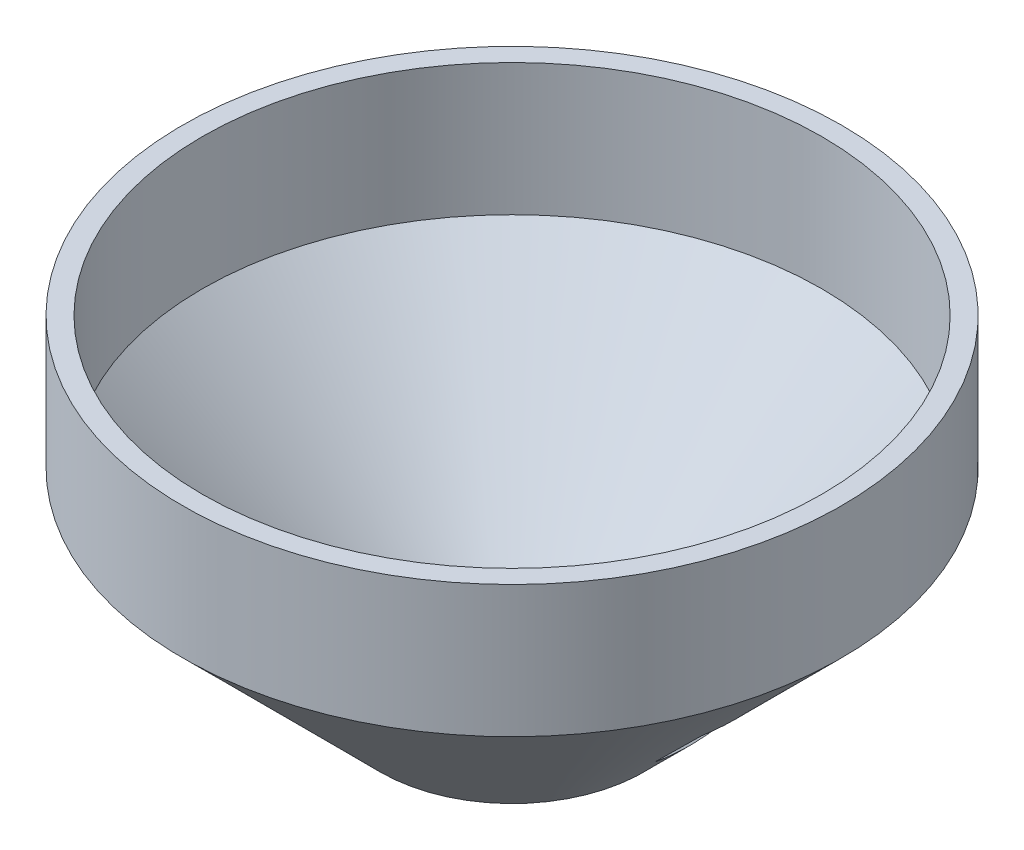
ISO-10303-21;
HEADER;
FILE_DESCRIPTION(('STEP AP214'),'2;1');
FILE_NAME('part.step','',(''),(''),'','','');
FILE_SCHEMA(('AUTOMOTIVE_DESIGN { 1 0 10303 214 1 1 1 1 }'));
ENDSEC;
DATA;
#1=APPLICATION_CONTEXT('core data for automotive mechanical design processes');
#2=APPLICATION_PROTOCOL_DEFINITION('international standard','automotive_design',2000,#1);
#3=PRODUCT_CONTEXT('',#1,'mechanical');
#4=PRODUCT('Part','Part','',(#3));
#5=PRODUCT_RELATED_PRODUCT_CATEGORY('part','',(#4));
#6=PRODUCT_DEFINITION_FORMATION('','',#4);
#7=PRODUCT_DEFINITION_CONTEXT('part definition',#1,'design');
#8=PRODUCT_DEFINITION('design','',#6,#7);
#9=PRODUCT_DEFINITION_SHAPE('','',#8);
#10=(LENGTH_UNIT() NAMED_UNIT(*) SI_UNIT(.MILLI.,.METRE.));
#11=(NAMED_UNIT(*) PLANE_ANGLE_UNIT() SI_UNIT($,.RADIAN.));
#12=(NAMED_UNIT(*) SI_UNIT($,.STERADIAN.) SOLID_ANGLE_UNIT());
#13=UNCERTAINTY_MEASURE_WITH_UNIT(LENGTH_MEASURE(1.E-05),#10,'distance_accuracy_value','');
#14=(GEOMETRIC_REPRESENTATION_CONTEXT(3) GLOBAL_UNCERTAINTY_ASSIGNED_CONTEXT((#13)) GLOBAL_UNIT_ASSIGNED_CONTEXT((#10,
#11,#12)) REPRESENTATION_CONTEXT('',''));
#15=CARTESIAN_POINT('',(0.,0.,0.));
#16=DIRECTION('',(0.,0.,1.));
#17=DIRECTION('',(1.,0.,0.));
#18=AXIS2_PLACEMENT_3D('',#15,#16,#17);
#19=CARTESIAN_POINT('',(0.,30.,0.));
#20=DIRECTION('',(0.,1.,0.));
#21=DIRECTION('',(0.,0.,1.));
#22=AXIS2_PLACEMENT_3D('',#19,#20,#21);
#23=CONICAL_SURFACE('',#22,47.,0.78539816339745);
#24=CARTESIAN_POINT('',(0.,0.,0.));
#25=DIRECTION('',(0.,-1.,0.));
#26=DIRECTION('',(0.,0.,-1.));
#27=AXIS2_PLACEMENT_3D('',#24,#25,#26);
#28=CIRCLE('',#27,16.9999999999999);
#29=CARTESIAN_POINT('',(0.,0.,-16.9999999999999));
#30=VERTEX_POINT('',#29);
#31=EDGE_CURVE('E249',#30,#30,#28,.T.);
#32=ORIENTED_EDGE('',*,*,#31,.T.);
#33=EDGE_LOOP('',(#32));
#34=FACE_BOUND('',#33,.T.);
#35=CARTESIAN_POINT('',(0.,30.,0.));
#36=DIRECTION('',(0.,-1.,0.));
#37=DIRECTION('',(0.,0.,-1.));
#38=AXIS2_PLACEMENT_3D('',#35,#36,#37);
#39=CIRCLE('',#38,47.);
#40=CARTESIAN_POINT('',(0.,30.,-47.));
#41=VERTEX_POINT('',#40);
#42=EDGE_CURVE('E252',#41,#41,#39,.T.);
#43=ORIENTED_EDGE('',*,*,#42,.F.);
#44=EDGE_LOOP('',(#43));
#45=FACE_BOUND('',#44,.T.);
#46=CARTESIAN_POINT('',(32.4365220756595,15.8481259873356,5.18376470483706));
#47=CARTESIAN_POINT('',(32.4694450800554,15.8150731722791,4.76835895172613));
#48=CARTESIAN_POINT('',(32.498458012653,15.7859560803706,4.35232807358459));
#49=CARTESIAN_POINT('',(32.5485988600801,15.7356632888784,3.51932975536683));
#50=CARTESIAN_POINT('',(32.5697270985214,15.7144872633688,3.10236235443518));
#51=CARTESIAN_POINT('',(32.6040365546045,15.6801436679165,2.26776668741939));
#52=CARTESIAN_POINT('',(32.617217699118,15.6669761716673,1.85013841528943));
#53=CARTESIAN_POINT('',(32.6355739481844,15.6486654615326,1.01451238189933));
#54=CARTESIAN_POINT('',(32.6407487170047,15.6435225841446,0.596514605880074));
#55=CARTESIAN_POINT('',(32.6430272524225,15.641243931721,-0.236874199899568));
#56=CARTESIAN_POINT('',(32.6401819845196,15.6440575950556,-0.652264953633132));
#57=CARTESIAN_POINT('',(32.6265770706278,15.6576144617477,-1.48280784440092));
#58=CARTESIAN_POINT('',(32.6158170341306,15.6683580563619,-1.89795996864986));
#59=CARTESIAN_POINT('',(32.5864268011897,15.6977709980974,-2.72786173149276));
#60=CARTESIAN_POINT('',(32.5677936200702,15.7164433509907,-3.14261115759877));
#61=CARTESIAN_POINT('',(32.5227113898148,15.761649470732,-3.97123429434165));
#62=CARTESIAN_POINT('',(32.4962627507807,15.7881828250885,-4.38510804978036));
#63=CARTESIAN_POINT('',(32.4659327442438,15.8186152793169,-4.79840805872562));
#64=B_SPLINE_CURVE_WITH_KNOTS('',3,(#46,#47,#48,#49,#50,#51,#52,#53,#54,#55,#56,#57,#58,#59,#60,
#61,#62,#63),.UNSPECIFIED.,.F.,.F.,(4,2,2,2,2,2,2,2,4),(0.,1.25401734263222,2.50798321090494,
3.76196061787041,5.01599060663924,6.2620695207451,7.5082099195202,8.75482314928744,
10.0013709769121),.UNSPECIFIED.);
#65=CARTESIAN_POINT('',(32.4365220756595,15.8481259873356,5.18376470483706));
#66=VERTEX_POINT('',#65);
#67=CARTESIAN_POINT('',(32.4659327442438,15.8186152793169,-4.79840805872562));
#68=VERTEX_POINT('',#67);
#69=EDGE_CURVE('E168',#66,#68,#64,.T.);
#70=ORIENTED_EDGE('',*,*,#69,.F.);
#71=CARTESIAN_POINT('',(23.7495216562269,7.30715868939393,5.17669630669847));
#72=CARTESIAN_POINT('',(24.6029988649145,8.14126205496725,5.17738869779099));
#73=CARTESIAN_POINT('',(25.4555241593354,8.97633778157335,5.17808109727255));
#74=CARTESIAN_POINT('',(27.1590578274479,10.648031842227,5.17946590677456));
#75=CARTESIAN_POINT('',(28.0100662042037,11.4846501731514,5.18015831679499));
#76=CARTESIAN_POINT('',(29.7109555956922,13.159029919179,5.18154314328644));
#77=CARTESIAN_POINT('',(30.560836611482,13.9967913332089,5.18223555975745));
#78=CARTESIAN_POINT('',(32.2597024026139,15.6732258786803,5.18362039904945));
#79=CARTESIAN_POINT('',(33.1086871761581,16.5118990119439,5.18431282187046));
#80=CARTESIAN_POINT('',(33.957337288326,17.3509102516262,5.18500524610492));
#81=B_SPLINE_CURVE_WITH_KNOTS('',3,(#71,#72,#73,#74,#75,#76,#77,#78,#79,#80),.UNSPECIFIED.,.F.,
.F.,(4,2,2,2,4),(0.,3.58013307178191,7.160258903314,10.7403813755078,14.3205110159919),.UNSPECIFIED.);
#82=CARTESIAN_POINT('',(25.3093219493662,8.83356486333209,5.17796253475305));
#83=VERTEX_POINT('',#82);
#84=EDGE_CURVE('E141',#83,#66,#81,.T.);
#85=ORIENTED_EDGE('',*,*,#84,.F.);
#86=CARTESIAN_POINT('',(25.3466735901965,8.79601428599723,-4.7937971333172));
#87=CARTESIAN_POINT('',(25.3854921448179,8.75698677645437,-4.37862585579368));
#88=CARTESIAN_POINT('',(25.4193465688135,8.72296162648883,-3.9625152790789));
#89=CARTESIAN_POINT('',(25.4770108511066,8.665049811435,-3.12892469883759));
#90=CARTESIAN_POINT('',(25.5008214022804,8.64116244699127,-2.71144479177727));
#91=CARTESIAN_POINT('',(25.5382874430402,8.60365412602208,-1.87555792023454));
#92=CARTESIAN_POINT('',(25.551942704722,8.59003339989984,-1.45715093515804));
#93=CARTESIAN_POINT('',(25.5689932651211,8.57308021987672,-0.619890430840907));
#94=CARTESIAN_POINT('',(25.5723878590317,8.56974847272707,-0.201036882902567));
#95=CARTESIAN_POINT('',(25.5688380333383,8.57329678409761,0.632440965368637));
#96=CARTESIAN_POINT('',(25.5619955036252,8.58007620428622,1.04706613621983));
#97=CARTESIAN_POINT('',(25.538270940098,8.60371258926543,1.87577574230315));
#98=CARTESIAN_POINT('',(25.5213880743384,8.62057038915439,2.28986012987595));
#99=CARTESIAN_POINT('',(25.4776878548735,8.66434279482382,3.11722546740543));
#100=CARTESIAN_POINT('',(25.4508644069629,8.69126356993195,3.53050576783811));
#101=CARTESIAN_POINT('',(25.3874137452699,8.75501657703397,4.35550814524432));
#102=CARTESIAN_POINT('',(25.3507874495712,8.79184788086093,4.7672303644795));
#103=CARTESIAN_POINT('',(25.3093219493663,8.83356486333203,5.17796253475305));
#104=B_SPLINE_CURVE_WITH_KNOTS('',3,(#86,#87,#88,#89,#90,#91,#92,#93,#94,#95,#96,#97,#98,#99,
#100,#101,#102,#103),.UNSPECIFIED.,.F.,.F.,(4,2,2,2,2,2,2,2,4),(0.,1.25636057478894,
2.51263446541363,3.76893654841518,5.02532492504258,6.26929140261459,7.5133609700089,
8.75819449580275,10.0029114777228),.UNSPECIFIED.);
#105=CARTESIAN_POINT('',(25.3466735901965,8.79601428599723,-4.7937971333172));
#106=VERTEX_POINT('',#105);
#107=EDGE_CURVE('E138',#106,#83,#104,.T.);
#108=ORIENTED_EDGE('',*,*,#107,.F.);
#109=CARTESIAN_POINT('',(33.9854468083045,17.3226568960614,-4.7993938830491));
#110=CARTESIAN_POINT('',(33.1378559005009,16.4833335955597,-4.79884386802251));
#111=CARTESIAN_POINT('',(32.2899778425102,15.6442999802321,-4.79829385382245));
#112=CARTESIAN_POINT('',(30.5934524573856,13.9670134014633,-4.79719382913366));
#113=CARTESIAN_POINT('',(29.7448051313863,13.1287604368747,-4.79664381864492));
#114=CARTESIAN_POINT('',(28.046543160166,11.4532333896772,-4.79554380143745));
#115=CARTESIAN_POINT('',(27.1969285142773,10.6159593077451,-4.79499379471873));
#116=CARTESIAN_POINT('',(25.4963975786633,8.94273167493375,-4.79389378743942));
#117=CARTESIAN_POINT('',(24.6454812870042,8.10677812602028,-4.79334378687884));
#118=CARTESIAN_POINT('',(23.793747980283,7.27165662402085,-4.79279379121938));
#119=B_SPLINE_CURVE_WITH_KNOTS('',3,(#109,#110,#111,#112,#113,#114,#115,#116,#117,#118),
.UNSPECIFIED.,.F.,.F.,(4,2,2,2,4),(0.,3.57852899811041,7.15705272737192,10.7355789286101,
14.314110451587),.UNSPECIFIED.);
#120=EDGE_CURVE('E89',#68,#106,#119,.T.);
#121=ORIENTED_EDGE('',*,*,#120,.F.);
#122=EDGE_LOOP('',(#70,#85,#108,#121));
#123=FACE_BOUND('',#122,.T.);
#124=ADVANCED_FACE('F84',(#34,#45,#123),#23,.F.);
#125=CARTESIAN_POINT('',(19.9999999999999,0.,0.));
#126=DIRECTION('',(0.,-1.,0.));
#127=DIRECTION('',(0.,0.,-1.));
#128=AXIS2_PLACEMENT_3D('',#125,#126,#127);
#129=PLANE('',#128);
#130=CARTESIAN_POINT('',(0.,0.,0.));
#131=DIRECTION('',(0.,-1.,0.));
#132=DIRECTION('',(0.,0.,-1.));
#133=AXIS2_PLACEMENT_3D('',#130,#131,#132);
#134=CIRCLE('',#133,19.9999999999999);
#135=CARTESIAN_POINT('',(0.,0.,-19.9999999999999));
#136=VERTEX_POINT('',#135);
#137=EDGE_CURVE('E151',#136,#136,#134,.T.);
#138=ORIENTED_EDGE('',*,*,#137,.T.);
#139=EDGE_LOOP('',(#138));
#140=FACE_BOUND('',#139,.T.);
#141=ORIENTED_EDGE('',*,*,#31,.F.);
#142=EDGE_LOOP('',(#141));
#143=FACE_BOUND('',#142,.T.);
#144=ADVANCED_FACE('F312',(#140,#143),#129,.T.);
#145=CARTESIAN_POINT('',(0.,0.,0.));
#146=DIRECTION('',(0.,-1.,0.));
#147=DIRECTION('',(0.,0.,-1.));
#148=AXIS2_PLACEMENT_3D('',#145,#146,#147);
#149=CYLINDRICAL_SURFACE('',#148,47.);
#150=ORIENTED_EDGE('',*,*,#42,.T.);
#151=EDGE_LOOP('',(#150));
#152=FACE_BOUND('',#151,.T.);
#153=CARTESIAN_POINT('',(0.,50.,0.));
#154=DIRECTION('',(0.,-1.,0.));
#155=DIRECTION('',(0.,0.,-1.));
#156=AXIS2_PLACEMENT_3D('',#153,#154,#155);
#157=CIRCLE('',#156,47.);
#158=CARTESIAN_POINT('',(0.,50.,-47.));
#159=VERTEX_POINT('',#158);
#160=EDGE_CURVE('E255',#159,#159,#157,.T.);
#161=ORIENTED_EDGE('',*,*,#160,.F.);
#162=EDGE_LOOP('',(#161));
#163=FACE_BOUND('',#162,.T.);
#164=ADVANCED_FACE('F308',(#152,#163),#149,.F.);
#165=CARTESIAN_POINT('',(47.,50.,0.));
#166=DIRECTION('',(0.,1.,0.));
#167=DIRECTION('',(0.,0.,1.));
#168=AXIS2_PLACEMENT_3D('',#165,#166,#167);
#169=PLANE('',#168);
#170=ORIENTED_EDGE('',*,*,#160,.T.);
#171=EDGE_LOOP('',(#170));
#172=FACE_BOUND('',#171,.T.);
#173=CARTESIAN_POINT('',(0.,50.,0.));
#174=DIRECTION('',(0.,-1.,0.));
#175=DIRECTION('',(0.,0.,-1.));
#176=AXIS2_PLACEMENT_3D('',#173,#174,#175);
#177=CIRCLE('',#176,50.);
#178=CARTESIAN_POINT('',(0.,50.,-50.));
#179=VERTEX_POINT('',#178);
#180=EDGE_CURVE('E258',#179,#179,#177,.T.);
#181=ORIENTED_EDGE('',*,*,#180,.F.);
#182=EDGE_LOOP('',(#181));
#183=FACE_BOUND('',#182,.T.);
#184=ADVANCED_FACE('F302',(#172,#183),#169,.T.);
#185=CARTESIAN_POINT('',(0.,0.,0.));
#186=DIRECTION('',(0.,-1.,0.));
#187=DIRECTION('',(0.,0.,-1.));
#188=AXIS2_PLACEMENT_3D('',#185,#186,#187);
#189=CYLINDRICAL_SURFACE('',#188,50.);
#190=ORIENTED_EDGE('',*,*,#180,.T.);
#191=EDGE_LOOP('',(#190));
#192=FACE_BOUND('',#191,.T.);
#193=CARTESIAN_POINT('',(0.,30.,0.));
#194=DIRECTION('',(0.,-1.,0.));
#195=DIRECTION('',(0.,0.,-1.));
#196=AXIS2_PLACEMENT_3D('',#193,#194,#195);
#197=CIRCLE('',#196,50.);
#198=CARTESIAN_POINT('',(0.,30.,-50.));
#199=VERTEX_POINT('',#198);
#200=EDGE_CURVE('E260',#199,#199,#197,.T.);
#201=ORIENTED_EDGE('',*,*,#200,.F.);
#202=EDGE_LOOP('',(#201));
#203=FACE_BOUND('',#202,.T.);
#204=ADVANCED_FACE('F300',(#192,#203),#189,.T.);
#205=CARTESIAN_POINT('',(0.,0.,0.));
#206=DIRECTION('',(0.,1.,0.));
#207=DIRECTION('',(0.,0.,1.));
#208=AXIS2_PLACEMENT_3D('',#205,#206,#207);
#209=CONICAL_SURFACE('',#208,19.9999999999999,0.78539816339745);
#210=CARTESIAN_POINT('',(33.9736800870603,14.3108679365003,-4.79840805872562));
#211=CARTESIAN_POINT('',(33.9903746721843,14.2941184544966,-4.56044043587117));
#212=CARTESIAN_POINT('',(34.0212522762408,14.2631338309738,-4.08488607484685));
#213=CARTESIAN_POINT('',(34.0599418385881,14.2243219621445,-3.37368860626202));
#214=CARTESIAN_POINT('',(34.091511632338,14.1926809142468,-2.66098278211333));
#215=CARTESIAN_POINT('',(34.1155367679409,14.1686390458385,-1.94800137782458));
#216=CARTESIAN_POINT('',(34.1321842146789,14.1520186652835,-1.23461464565158));
#217=CARTESIAN_POINT('',(34.1413871067532,14.1428634934136,-0.520657818124978));
#218=CARTESIAN_POINT('',(34.1435337278215,14.140755835998,0.372152081058835));
#219=CARTESIAN_POINT('',(34.1307322399073,14.1534739141584,1.44322396117087));
#220=CARTESIAN_POINT('',(34.09256623302,14.1916020498114,2.69154592579828));
#221=CARTESIAN_POINT('',(34.032467553344,14.251838408885,3.93667517354538));
#222=CARTESIAN_POINT('',(33.9770831547138,14.3074440255315,4.76776508554748));
#223=CARTESIAN_POINT('',(33.9455637253572,14.3390843376379,5.18376470483706));
#224=B_SPLINE_CURVE_WITH_KNOTS('',3,(#210,#211,#212,#213,#214,#215,#216,#217,#218,#219,#220,
#221,#222,#223),.UNSPECIFIED.,.F.,.F.,(4,1,1,1,1,1,1,1,1,1,1,4),(0.,0.0715568307664177,
0.143019687373004,0.214419310225234,0.285786582770491,0.357152501779411,0.428548147187089,
0.500004651688761,0.62499407839524,0.749879278644326,0.874826270317929,1.),.UNSPECIFIED.);
#225=CARTESIAN_POINT('',(33.9738876455101,14.3106594351518,-4.79840673380645));
#226=VERTEX_POINT('',#225);
#227=CARTESIAN_POINT('',(33.9457747259247,14.3388723785348,5.18376605172849));
#228=VERTEX_POINT('',#227);
#229=EDGE_CURVE('E172',#226,#228,#224,.T.);
#230=ORIENTED_EDGE('',*,*,#229,.F.);
#231=CARTESIAN_POINT('',(26.8591223819012,7.28356549429251,-4.7937971333172));
#232=DIRECTION('',(0.711456011646425,0.702730482393988,-0.000461092697119019));
#233=VECTOR('',#232,1.);
#234=LINE('',#231,#233);
#235=CARTESIAN_POINT('',(26.859396303793,7.28329032802541,-4.79379538477664));
#236=VERTEX_POINT('',#235);
#237=EDGE_CURVE('E134',#236,#226,#234,.T.);
#238=ORIENTED_EDGE('',*,*,#237,.F.);
#239=CARTESIAN_POINT('',(26.8238458216095,7.31904099108878,5.17796253475305));
#240=CARTESIAN_POINT('',(26.8436779436749,7.29908835610018,4.96995395406102));
#241=CARTESIAN_POINT('',(26.8809085030414,7.26162759402754,4.55440028441117));
#242=CARTESIAN_POINT('',(26.9292788478967,7.21298266293625,3.93448769051655));
#243=CARTESIAN_POINT('',(26.9709321619335,7.17114063555592,3.31228421816584));
#244=CARTESIAN_POINT('',(27.0053640190078,7.13661510133221,2.68975404357664));
#245=CARTESIAN_POINT('',(27.032735579263,7.10923557804791,2.06676564265162));
#246=CARTESIAN_POINT('',(27.0529767852719,7.08904878334026,1.44314618256511));
#247=CARTESIAN_POINT('',(27.0660655490795,7.07603842566997,0.818729667805053));
#248=CARTESIAN_POINT('',(27.0738773664383,7.06829019603558,-0.0145068947052184));
#249=CARTESIAN_POINT('',(27.0656023645485,7.07640425103128,-1.05582928298961));
#250=CARTESIAN_POINT('',(27.0263847473001,7.11552592516898,-2.30385540297093));
#251=CARTESIAN_POINT('',(26.9596311901488,7.182498773558,-3.54730566782196));
#252=CARTESIAN_POINT('',(26.8958578257031,7.24663854952568,-4.37780529189792));
#253=CARTESIAN_POINT('',(26.8591223819012,7.28356549429251,-4.7937971333172));
#254=B_SPLINE_CURVE_WITH_KNOTS('',3,(#239,#240,#241,#242,#243,#244,#245,#246,#247,#248,#249,
#250,#251,#252,#253),.UNSPECIFIED.,.F.,.F.,(4,1,1,1,1,1,1,1,1,1,1,1,4),(0.,0.062699714196477,
0.125277813353082,0.187766454492301,0.250198037339806,0.312605167534735,0.375020618841499,
0.437477294650758,0.500008189069383,0.625011917116613,0.749836291971401,0.874745146273385,1.),.UNSPECIFIED.);
#255=CARTESIAN_POINT('',(26.8241079073571,7.31877771491241,5.1779642077388));
#256=VERTEX_POINT('',#255);
#257=EDGE_CURVE('E99',#256,#236,#254,.T.);
#258=ORIENTED_EDGE('',*,*,#257,.F.);
#259=CARTESIAN_POINT('',(33.9455637253572,14.3390843376379,5.18376470483706));
#260=DIRECTION('',(-0.712172117428615,-0.702004657039507,-0.000580217274856255));
#261=VECTOR('',#260,1.);
#262=LINE('',#259,#261);
#263=EDGE_CURVE('E223',#228,#256,#262,.T.);
#264=ORIENTED_EDGE('',*,*,#263,.F.);
#265=EDGE_LOOP('',(#230,#238,#258,#264));
#266=FACE_BOUND('',#265,.T.);
#267=ORIENTED_EDGE('',*,*,#200,.T.);
#268=EDGE_LOOP('',(#267));
#269=FACE_BOUND('',#268,.T.);
#270=ORIENTED_EDGE('',*,*,#137,.F.);
#271=EDGE_LOOP('',(#270));
#272=FACE_BOUND('',#271,.T.);
#273=ADVANCED_FACE('F86',(#266,#269,#272),#209,.T.);
#274=CARTESIAN_POINT('',(33.9455637253572,14.3390843376379,5.18376470483706));
#275=DIRECTION('',(0.00041028617331353,0.000410286173313706,-0.999999831665242));
#276=DIRECTION('',(0.,0.99999991583261,0.00041028620784642));
#277=AXIS2_PLACEMENT_3D('',#274,#275,#276);
#278=PLANE('',#277);
#279=ORIENTED_EDGE('',*,*,#84,.T.);
#280=DIRECTION('',(-0.707106781186546,0.707106781186548,0.));
#281=VECTOR('',#280,1.);
#282=CARTESIAN_POINT('',(33.9455637253572,14.3390843376379,5.18376470483706));
#283=LINE('',#282,#281);
#284=EDGE_CURVE('E135',#228,#66,#283,.T.);
#285=ORIENTED_EDGE('',*,*,#284,.F.);
#286=ORIENTED_EDGE('',*,*,#263,.T.);
#287=DIRECTION('',(-0.707106781186546,0.707106781186548,0.));
#288=VECTOR('',#287,1.);
#289=CARTESIAN_POINT('',(26.8238458216095,7.31904099108878,5.17796253475305));
#290=LINE('',#289,#288);
#291=EDGE_CURVE('E173',#256,#83,#290,.T.);
#292=ORIENTED_EDGE('',*,*,#291,.T.);
#293=EDGE_LOOP('',(#279,#285,#286,#292));
#294=FACE_BOUND('',#293,.T.);
#295=ADVANCED_FACE('F161',(#294),#278,.T.);
#296=CARTESIAN_POINT('',(33.9736800870603,14.3108679365003,-4.79840805872562));
#297=CARTESIAN_POINT('',(33.9903746721843,14.2941184544966,-4.56044043587117));
#298=CARTESIAN_POINT('',(34.0212522762408,14.2631338309738,-4.08488607484685));
#299=CARTESIAN_POINT('',(34.0599418385881,14.2243219621445,-3.37368860626202));
#300=CARTESIAN_POINT('',(34.091511632338,14.1926809142468,-2.66098278211333));
#301=CARTESIAN_POINT('',(34.1155367679409,14.1686390458385,-1.94800137782458));
#302=CARTESIAN_POINT('',(34.1321842146789,14.1520186652835,-1.23461464565158));
#303=CARTESIAN_POINT('',(34.1413871067532,14.1428634934136,-0.520657818124978));
#304=CARTESIAN_POINT('',(34.1435337278215,14.140755835998,0.372152081058835));
#305=CARTESIAN_POINT('',(34.1307322399073,14.1534739141584,1.44322396117087));
#306=CARTESIAN_POINT('',(34.09256623302,14.1916020498114,2.69154592579828));
#307=CARTESIAN_POINT('',(34.032467553344,14.251838408885,3.93667517354538));
#308=CARTESIAN_POINT('',(33.9770831547138,14.3074440255315,4.76776508554748));
#309=CARTESIAN_POINT('',(33.9455637253572,14.3390843376379,5.18376470483706));
#310=B_SPLINE_CURVE_WITH_KNOTS('',3,(#296,#297,#298,#299,#300,#301,#302,#303,#304,#305,#306,
#307,#308,#309),.UNSPECIFIED.,.F.,.F.,(4,1,1,1,1,1,1,1,1,1,1,4),(0.,0.0715568307664177,
0.143019687373004,0.214419310225234,0.285786582770491,0.357152501779411,0.428548147187089,
0.500004651688761,0.62499407839524,0.749879278644326,0.874826270317929,1.),.UNSPECIFIED.);
#311=DIRECTION('',(-0.707106781186546,0.707106781186548,0.));
#312=VECTOR('',#311,1.);
#313=SURFACE_OF_LINEAR_EXTRUSION('',#310,#312);
#314=ORIENTED_EDGE('',*,*,#69,.T.);
#315=DIRECTION('',(-0.707106781186546,0.707106781186548,0.));
#316=VECTOR('',#315,1.);
#317=CARTESIAN_POINT('',(33.9736800870603,14.3108679365003,-4.79840805872562));
#318=LINE('',#317,#316);
#319=EDGE_CURVE('E129',#226,#68,#318,.T.);
#320=ORIENTED_EDGE('',*,*,#319,.F.);
#321=ORIENTED_EDGE('',*,*,#229,.T.);
#322=ORIENTED_EDGE('',*,*,#284,.T.);
#323=EDGE_LOOP('',(#314,#320,#321,#322));
#324=FACE_BOUND('',#323,.T.);
#325=ADVANCED_FACE('F178',(#324),#313,.T.);
#326=CARTESIAN_POINT('',(26.8591223819012,7.28356549429251,-4.7937971333172));
#327=DIRECTION('',(0.00032604797885197,0.000326047978851791,0.99999989369271));
#328=DIRECTION('',(0.999999946846351,0.,-0.000326047996182609));
#329=AXIS2_PLACEMENT_3D('',#326,#327,#328);
#330=PLANE('',#329);
#331=ORIENTED_EDGE('',*,*,#120,.T.);
#332=DIRECTION('',(-0.707106781186546,0.707106781186548,0.));
#333=VECTOR('',#332,1.);
#334=CARTESIAN_POINT('',(26.8591223819012,7.28356549429251,-4.7937971333172));
#335=LINE('',#334,#333);
#336=EDGE_CURVE('E13',#236,#106,#335,.T.);
#337=ORIENTED_EDGE('',*,*,#336,.F.);
#338=ORIENTED_EDGE('',*,*,#237,.T.);
#339=ORIENTED_EDGE('',*,*,#319,.T.);
#340=EDGE_LOOP('',(#331,#337,#338,#339));
#341=FACE_BOUND('',#340,.T.);
#342=ADVANCED_FACE('F126',(#341),#330,.T.);
#343=CARTESIAN_POINT('',(26.8238458216095,7.31904099108878,5.17796253475305));
#344=CARTESIAN_POINT('',(26.8436779436749,7.29908835610018,4.96995395406102));
#345=CARTESIAN_POINT('',(26.8809085030414,7.26162759402754,4.55440028441117));
#346=CARTESIAN_POINT('',(26.9292788478967,7.21298266293625,3.93448769051655));
#347=CARTESIAN_POINT('',(26.9709321619335,7.17114063555592,3.31228421816584));
#348=CARTESIAN_POINT('',(27.0053640190078,7.13661510133221,2.68975404357664));
#349=CARTESIAN_POINT('',(27.032735579263,7.10923557804791,2.06676564265162));
#350=CARTESIAN_POINT('',(27.0529767852719,7.08904878334026,1.44314618256511));
#351=CARTESIAN_POINT('',(27.0660655490795,7.07603842566997,0.818729667805053));
#352=CARTESIAN_POINT('',(27.0738773664383,7.06829019603558,-0.0145068947052184));
#353=CARTESIAN_POINT('',(27.0656023645485,7.07640425103128,-1.05582928298961));
#354=CARTESIAN_POINT('',(27.0263847473001,7.11552592516898,-2.30385540297093));
#355=CARTESIAN_POINT('',(26.9596311901488,7.182498773558,-3.54730566782196));
#356=CARTESIAN_POINT('',(26.8958578257031,7.24663854952568,-4.37780529189792));
#357=CARTESIAN_POINT('',(26.8591223819012,7.28356549429251,-4.7937971333172));
#358=B_SPLINE_CURVE_WITH_KNOTS('',3,(#343,#344,#345,#346,#347,#348,#349,#350,#351,#352,#353,
#354,#355,#356,#357),.UNSPECIFIED.,.F.,.F.,(4,1,1,1,1,1,1,1,1,1,1,1,4),(0.,0.062699714196477,
0.125277813353082,0.187766454492301,0.250198037339806,0.312605167534735,0.375020618841499,
0.437477294650758,0.500008189069383,0.625011917116613,0.749836291971401,0.874745146273385,1.),.UNSPECIFIED.);
#359=DIRECTION('',(-0.707106781186546,0.707106781186548,0.));
#360=VECTOR('',#359,1.);
#361=SURFACE_OF_LINEAR_EXTRUSION('',#358,#360);
#362=ORIENTED_EDGE('',*,*,#107,.T.);
#363=ORIENTED_EDGE('',*,*,#291,.F.);
#364=ORIENTED_EDGE('',*,*,#257,.T.);
#365=ORIENTED_EDGE('',*,*,#336,.T.);
#366=EDGE_LOOP('',(#362,#363,#364,#365));
#367=FACE_BOUND('',#366,.T.);
#368=ADVANCED_FACE('F137',(#367),#361,.T.);
#369=CLOSED_SHELL('',(#124,#144,#164,#184,#204,#273,#295,#325,#342,#368));
#370=MANIFOLD_SOLID_BREP('B2',#369);
#371=ADVANCED_BREP_SHAPE_REPRESENTATION('',(#18,#370),#14);
#372=SHAPE_DEFINITION_REPRESENTATION(#9,#371);
ENDSEC;
END-ISO-10303-21;
